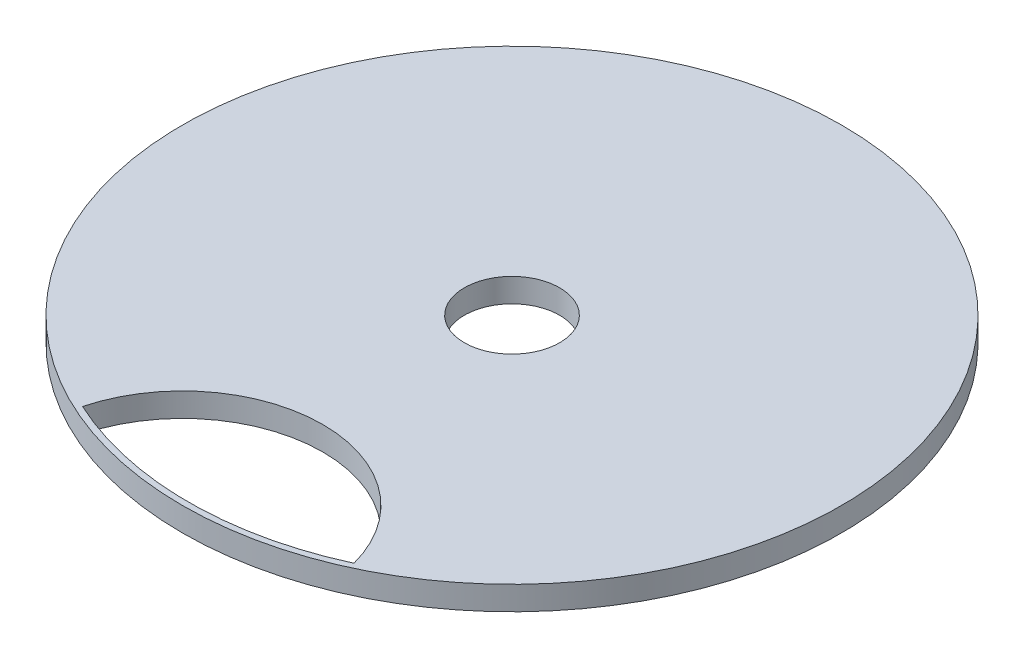
ISO-10303-21;
HEADER;
FILE_DESCRIPTION(('STEP AP214'),'2;1');
FILE_NAME('part.step','',(''),(''),'','','');
FILE_SCHEMA(('AUTOMOTIVE_DESIGN { 1 0 10303 214 1 1 1 1 }'));
ENDSEC;
DATA;
#1=APPLICATION_CONTEXT('core data for automotive mechanical design processes');
#2=APPLICATION_PROTOCOL_DEFINITION('international standard','automotive_design',2000,#1);
#3=PRODUCT_CONTEXT('',#1,'mechanical');
#4=PRODUCT('Part','Part','',(#3));
#5=PRODUCT_RELATED_PRODUCT_CATEGORY('part','',(#4));
#6=PRODUCT_DEFINITION_FORMATION('','',#4);
#7=PRODUCT_DEFINITION_CONTEXT('part definition',#1,'design');
#8=PRODUCT_DEFINITION('design','',#6,#7);
#9=PRODUCT_DEFINITION_SHAPE('','',#8);
#10=(LENGTH_UNIT() NAMED_UNIT(*) SI_UNIT(.MILLI.,.METRE.));
#11=(NAMED_UNIT(*) PLANE_ANGLE_UNIT() SI_UNIT($,.RADIAN.));
#12=(NAMED_UNIT(*) SI_UNIT($,.STERADIAN.) SOLID_ANGLE_UNIT());
#13=UNCERTAINTY_MEASURE_WITH_UNIT(LENGTH_MEASURE(1.E-05),#10,'distance_accuracy_value','');
#14=(GEOMETRIC_REPRESENTATION_CONTEXT(3) GLOBAL_UNCERTAINTY_ASSIGNED_CONTEXT((#13)) GLOBAL_UNIT_ASSIGNED_CONTEXT((#10,
#11,#12)) REPRESENTATION_CONTEXT('',''));
#15=CARTESIAN_POINT('',(0.,0.,0.));
#16=DIRECTION('',(0.,0.,1.));
#17=DIRECTION('',(1.,0.,0.));
#18=AXIS2_PLACEMENT_3D('',#15,#16,#17);
#19=CARTESIAN_POINT('',(0.,3.,0.));
#20=DIRECTION('',(0.,1.,0.));
#21=DIRECTION('',(0.,0.,1.));
#22=AXIS2_PLACEMENT_3D('',#19,#20,#21);
#23=PLANE('',#22);
#24=CARTESIAN_POINT('',(0.,3.,41.5));
#25=DIRECTION('',(0.,1.,0.));
#26=DIRECTION('',(0.,0.,1.));
#27=AXIS2_PLACEMENT_3D('',#24,#25,#26);
#28=CIRCLE('',#27,17.67622705974);
#29=CARTESIAN_POINT('',(17.0918087355738,3.,36.9923312883436));
#30=VERTEX_POINT('',#29);
#31=CARTESIAN_POINT('',(-17.0918087355738,3.,36.9923312883436));
#32=VERTEX_POINT('',#31);
#33=EDGE_CURVE('E48',#30,#32,#28,.T.);
#34=ORIENTED_EDGE('',*,*,#33,.F.);
#35=CARTESIAN_POINT('',(0.,3.,0.));
#36=DIRECTION('',(0.,1.,0.));
#37=DIRECTION('',(0.,0.,1.));
#38=AXIS2_PLACEMENT_3D('',#35,#36,#37);
#39=CIRCLE('',#38,40.75);
#40=EDGE_CURVE('E68',#32,#30,#39,.T.);
#41=ORIENTED_EDGE('',*,*,#40,.F.);
#42=EDGE_LOOP('',(#34,#41));
#43=FACE_BOUND('',#42,.T.);
#44=CARTESIAN_POINT('',(0.,3.,0.));
#45=DIRECTION('',(0.,1.,0.));
#46=DIRECTION('',(0.,0.,1.));
#47=AXIS2_PLACEMENT_3D('',#44,#45,#46);
#48=CIRCLE('',#47,41.5);
#49=CARTESIAN_POINT('',(0.,3.,41.5));
#50=VERTEX_POINT('',#49);
#51=EDGE_CURVE('E11',#50,#50,#48,.T.);
#52=ORIENTED_EDGE('',*,*,#51,.T.);
#53=EDGE_LOOP('',(#52));
#54=FACE_BOUND('',#53,.T.);
#55=CARTESIAN_POINT('',(0.,3.,0.));
#56=DIRECTION('',(0.,1.,0.));
#57=DIRECTION('',(0.,0.,1.));
#58=AXIS2_PLACEMENT_3D('',#55,#56,#57);
#59=CIRCLE('',#58,6.);
#60=CARTESIAN_POINT('',(0.,3.,6.));
#61=VERTEX_POINT('',#60);
#62=EDGE_CURVE('E79',#61,#61,#59,.T.);
#63=ORIENTED_EDGE('',*,*,#62,.F.);
#64=EDGE_LOOP('',(#63));
#65=FACE_BOUND('',#64,.T.);
#66=ADVANCED_FACE('F33',(#43,#54,#65),#23,.T.);
#67=CARTESIAN_POINT('',(0.,0.,0.));
#68=DIRECTION('',(0.,1.,0.));
#69=DIRECTION('',(0.,0.,1.));
#70=AXIS2_PLACEMENT_3D('',#67,#68,#69);
#71=PLANE('',#70);
#72=CARTESIAN_POINT('',(0.,0.,0.));
#73=DIRECTION('',(0.,1.,0.));
#74=DIRECTION('',(0.,0.,1.));
#75=AXIS2_PLACEMENT_3D('',#72,#73,#74);
#76=CIRCLE('',#75,40.75);
#77=CARTESIAN_POINT('',(-17.0918087355738,0.,36.9923312883436));
#78=VERTEX_POINT('',#77);
#79=CARTESIAN_POINT('',(17.0918087355738,0.,36.9923312883436));
#80=VERTEX_POINT('',#79);
#81=EDGE_CURVE('E75',#78,#80,#76,.T.);
#82=ORIENTED_EDGE('',*,*,#81,.T.);
#83=CARTESIAN_POINT('',(0.,0.,41.5));
#84=DIRECTION('',(0.,1.,0.));
#85=DIRECTION('',(0.,0.,1.));
#86=AXIS2_PLACEMENT_3D('',#83,#84,#85);
#87=CIRCLE('',#86,17.67622705974);
#88=EDGE_CURVE('E53',#80,#78,#87,.T.);
#89=ORIENTED_EDGE('',*,*,#88,.T.);
#90=EDGE_LOOP('',(#82,#89));
#91=FACE_BOUND('',#90,.T.);
#92=CARTESIAN_POINT('',(0.,0.,0.));
#93=DIRECTION('',(0.,1.,0.));
#94=DIRECTION('',(0.,0.,1.));
#95=AXIS2_PLACEMENT_3D('',#92,#93,#94);
#96=CIRCLE('',#95,41.5);
#97=CARTESIAN_POINT('',(0.,0.,41.5));
#98=VERTEX_POINT('',#97);
#99=EDGE_CURVE('E37',#98,#98,#96,.T.);
#100=ORIENTED_EDGE('',*,*,#99,.F.);
#101=EDGE_LOOP('',(#100));
#102=FACE_BOUND('',#101,.T.);
#103=CARTESIAN_POINT('',(0.,0.,0.));
#104=DIRECTION('',(0.,1.,0.));
#105=DIRECTION('',(0.,0.,1.));
#106=AXIS2_PLACEMENT_3D('',#103,#104,#105);
#107=CIRCLE('',#106,6.);
#108=CARTESIAN_POINT('',(0.,0.,6.));
#109=VERTEX_POINT('',#108);
#110=EDGE_CURVE('E64',#109,#109,#107,.T.);
#111=ORIENTED_EDGE('',*,*,#110,.T.);
#112=EDGE_LOOP('',(#111));
#113=FACE_BOUND('',#112,.T.);
#114=ADVANCED_FACE('F85',(#91,#102,#113),#71,.F.);
#115=CARTESIAN_POINT('',(0.,3.,0.));
#116=DIRECTION('',(0.,-1.,0.));
#117=DIRECTION('',(0.,0.,-1.));
#118=AXIS2_PLACEMENT_3D('',#115,#116,#117);
#119=CYLINDRICAL_SURFACE('',#118,41.5);
#120=ORIENTED_EDGE('',*,*,#51,.F.);
#121=EDGE_LOOP('',(#120));
#122=FACE_BOUND('',#121,.T.);
#123=ORIENTED_EDGE('',*,*,#99,.T.);
#124=EDGE_LOOP('',(#123));
#125=FACE_BOUND('',#124,.T.);
#126=ADVANCED_FACE('F35',(#122,#125),#119,.T.);
#127=CARTESIAN_POINT('',(0.,3.,0.));
#128=DIRECTION('',(0.,-1.,0.));
#129=DIRECTION('',(0.,0.,-1.));
#130=AXIS2_PLACEMENT_3D('',#127,#128,#129);
#131=CYLINDRICAL_SURFACE('',#130,6.);
#132=ORIENTED_EDGE('',*,*,#62,.T.);
#133=EDGE_LOOP('',(#132));
#134=FACE_BOUND('',#133,.T.);
#135=ORIENTED_EDGE('',*,*,#110,.F.);
#136=EDGE_LOOP('',(#135));
#137=FACE_BOUND('',#136,.T.);
#138=ADVANCED_FACE('F87',(#134,#137),#131,.F.);
#139=CARTESIAN_POINT('',(0.,0.,41.5));
#140=DIRECTION('',(0.,1.,0.));
#141=DIRECTION('',(0.,0.,1.));
#142=AXIS2_PLACEMENT_3D('',#139,#140,#141);
#143=CYLINDRICAL_SURFACE('',#142,17.67622705974);
#144=ORIENTED_EDGE('',*,*,#33,.T.);
#145=DIRECTION('',(0.,1.,0.));
#146=VECTOR('',#145,1.);
#147=CARTESIAN_POINT('',(-17.0918087355738,0.,36.9923312883436));
#148=LINE('',#147,#146);
#149=EDGE_CURVE('E65',#78,#32,#148,.T.);
#150=ORIENTED_EDGE('',*,*,#149,.F.);
#151=ORIENTED_EDGE('',*,*,#88,.F.);
#152=DIRECTION('',(0.,1.,0.));
#153=VECTOR('',#152,1.);
#154=CARTESIAN_POINT('',(17.0918087355738,0.,36.9923312883436));
#155=LINE('',#154,#153);
#156=EDGE_CURVE('E58',#80,#30,#155,.T.);
#157=ORIENTED_EDGE('',*,*,#156,.T.);
#158=EDGE_LOOP('',(#144,#150,#151,#157));
#159=FACE_BOUND('',#158,.T.);
#160=ADVANCED_FACE('F60',(#159),#143,.F.);
#161=CARTESIAN_POINT('',(0.,0.,0.));
#162=DIRECTION('',(0.,1.,0.));
#163=DIRECTION('',(0.,0.,1.));
#164=AXIS2_PLACEMENT_3D('',#161,#162,#163);
#165=CYLINDRICAL_SURFACE('',#164,40.75);
#166=ORIENTED_EDGE('',*,*,#40,.T.);
#167=ORIENTED_EDGE('',*,*,#156,.F.);
#168=ORIENTED_EDGE('',*,*,#81,.F.);
#169=ORIENTED_EDGE('',*,*,#149,.T.);
#170=EDGE_LOOP('',(#166,#167,#168,#169));
#171=FACE_BOUND('',#170,.T.);
#172=ADVANCED_FACE('F69',(#171),#165,.F.);
#173=CLOSED_SHELL('',(#66,#114,#126,#138,#160,#172));
#174=MANIFOLD_SOLID_BREP('B2',#173);
#175=ADVANCED_BREP_SHAPE_REPRESENTATION('',(#18,#174),#14);
#176=SHAPE_DEFINITION_REPRESENTATION(#9,#175);
ENDSEC;
END-ISO-10303-21;
